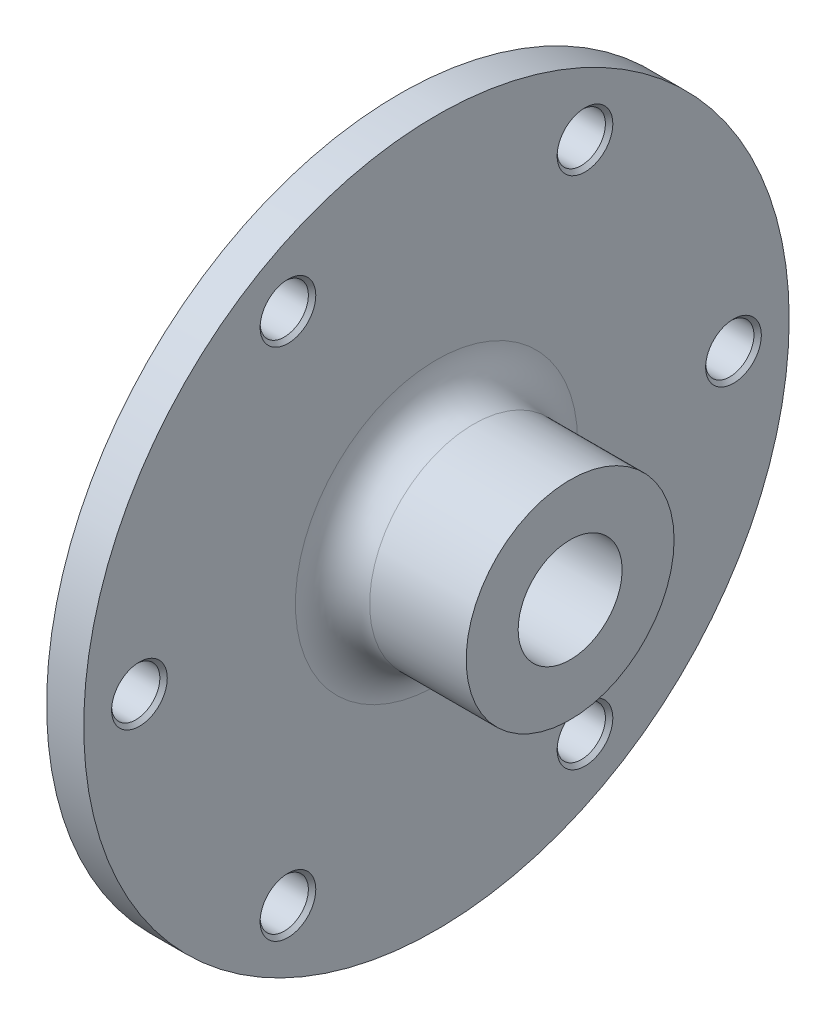
ISO-10303-21;
HEADER;
FILE_DESCRIPTION(('STEP AP214'),'2;1');
FILE_NAME('part.step','',(''),(''),'','','');
FILE_SCHEMA(('AUTOMOTIVE_DESIGN { 1 0 10303 214 1 1 1 1 }'));
ENDSEC;
DATA;
#1=APPLICATION_CONTEXT('core data for automotive mechanical design processes');
#2=APPLICATION_PROTOCOL_DEFINITION('international standard','automotive_design',2000,#1);
#3=PRODUCT_CONTEXT('',#1,'mechanical');
#4=PRODUCT('Part','Part','',(#3));
#5=PRODUCT_RELATED_PRODUCT_CATEGORY('part','',(#4));
#6=PRODUCT_DEFINITION_FORMATION('','',#4);
#7=PRODUCT_DEFINITION_CONTEXT('part definition',#1,'design');
#8=PRODUCT_DEFINITION('design','',#6,#7);
#9=PRODUCT_DEFINITION_SHAPE('','',#8);
#10=(LENGTH_UNIT() NAMED_UNIT(*) SI_UNIT(.MILLI.,.METRE.));
#11=(NAMED_UNIT(*) PLANE_ANGLE_UNIT() SI_UNIT($,.RADIAN.));
#12=(NAMED_UNIT(*) SI_UNIT($,.STERADIAN.) SOLID_ANGLE_UNIT());
#13=UNCERTAINTY_MEASURE_WITH_UNIT(LENGTH_MEASURE(1.E-05),#10,'distance_accuracy_value','');
#14=(GEOMETRIC_REPRESENTATION_CONTEXT(3) GLOBAL_UNCERTAINTY_ASSIGNED_CONTEXT((#13)) GLOBAL_UNIT_ASSIGNED_CONTEXT((#10,
#11,#12)) REPRESENTATION_CONTEXT('',''));
#15=CARTESIAN_POINT('',(0.,0.,0.));
#16=DIRECTION('',(0.,0.,1.));
#17=DIRECTION('',(1.,0.,0.));
#18=AXIS2_PLACEMENT_3D('',#15,#16,#17);
#19=CARTESIAN_POINT('',(0.,14.,0.));
#20=DIRECTION('',(1.,0.,0.));
#21=DIRECTION('',(0.,0.,-1.));
#22=AXIS2_PLACEMENT_3D('',#19,#20,#21);
#23=PLANE('',#22);
#24=CARTESIAN_POINT('',(0.,0.,0.));
#25=DIRECTION('',(-1.,0.,0.));
#26=DIRECTION('',(0.,0.,1.));
#27=AXIS2_PLACEMENT_3D('',#24,#25,#26);
#28=CIRCLE('',#27,6.99999999999999);
#29=CARTESIAN_POINT('',(0.,0.,6.99999999999999));
#30=VERTEX_POINT('',#29);
#31=EDGE_CURVE('E104',#30,#30,#28,.T.);
#32=ORIENTED_EDGE('',*,*,#31,.T.);
#33=EDGE_LOOP('',(#32));
#34=FACE_BOUND('',#33,.T.);
#35=CARTESIAN_POINT('',(0.,0.,0.));
#36=DIRECTION('',(1.,0.,0.));
#37=DIRECTION('',(0.,0.,-1.));
#38=AXIS2_PLACEMENT_3D('',#35,#36,#37);
#39=CIRCLE('',#38,14.);
#40=CARTESIAN_POINT('',(0.,0.,-14.));
#41=VERTEX_POINT('',#40);
#42=EDGE_CURVE('E107',#41,#41,#39,.T.);
#43=ORIENTED_EDGE('',*,*,#42,.T.);
#44=EDGE_LOOP('',(#43));
#45=FACE_BOUND('',#44,.T.);
#46=ADVANCED_FACE('F32',(#34,#45),#23,.T.);
#47=CARTESIAN_POINT('',(-28.,0.,0.));
#48=DIRECTION('',(-1.,0.,0.));
#49=DIRECTION('',(0.,0.,1.));
#50=AXIS2_PLACEMENT_3D('',#47,#48,#49);
#51=PLANE('',#50);
#52=CARTESIAN_POINT('',(-28.,0.,0.));
#53=DIRECTION('',(-1.,0.,0.));
#54=DIRECTION('',(0.,0.,1.));
#55=AXIS2_PLACEMENT_3D('',#52,#53,#54);
#56=CIRCLE('',#55,13.);
#57=CARTESIAN_POINT('',(-28.,0.,13.));
#58=VERTEX_POINT('',#57);
#59=EDGE_CURVE('E52',#58,#58,#56,.T.);
#60=ORIENTED_EDGE('',*,*,#59,.F.);
#61=EDGE_LOOP('',(#60));
#62=FACE_BOUND('',#61,.T.);
#63=CARTESIAN_POINT('',(-28.,0.,0.));
#64=DIRECTION('',(1.,0.,0.));
#65=DIRECTION('',(0.,0.,-1.));
#66=AXIS2_PLACEMENT_3D('',#63,#64,#65);
#67=CIRCLE('',#66,35.);
#68=CARTESIAN_POINT('',(-28.,0.,-35.));
#69=VERTEX_POINT('',#68);
#70=EDGE_CURVE('E45',#69,#69,#67,.T.);
#71=ORIENTED_EDGE('',*,*,#70,.F.);
#72=EDGE_LOOP('',(#71));
#73=FACE_BOUND('',#72,.T.);
#74=ADVANCED_FACE('F124',(#62,#73),#51,.T.);
#75=CARTESIAN_POINT('',(0.,0.,0.));
#76=DIRECTION('',(1.,0.,0.));
#77=DIRECTION('',(0.,0.,-1.));
#78=AXIS2_PLACEMENT_3D('',#75,#76,#77);
#79=CYLINDRICAL_SURFACE('',#78,35.);
#80=ORIENTED_EDGE('',*,*,#70,.T.);
#81=EDGE_LOOP('',(#80));
#82=FACE_BOUND('',#81,.T.);
#83=CARTESIAN_POINT('',(-23.,0.,0.));
#84=DIRECTION('',(1.,0.,0.));
#85=DIRECTION('',(0.,0.,-1.));
#86=AXIS2_PLACEMENT_3D('',#83,#84,#85);
#87=CIRCLE('',#86,35.);
#88=CARTESIAN_POINT('',(-23.,0.,-35.));
#89=VERTEX_POINT('',#88);
#90=EDGE_CURVE('E116',#89,#89,#87,.T.);
#91=ORIENTED_EDGE('',*,*,#90,.F.);
#92=EDGE_LOOP('',(#91));
#93=FACE_BOUND('',#92,.T.);
#94=ADVANCED_FACE('F121',(#82,#93),#79,.T.);
#95=CARTESIAN_POINT('',(-23.,35.,0.));
#96=DIRECTION('',(-1.,0.,0.));
#97=DIRECTION('',(0.,0.,1.));
#98=AXIS2_PLACEMENT_3D('',#95,#96,#97);
#99=PLANE('',#98);
#100=CARTESIAN_POINT('',(-23.,34.6410161513773,20.0000000000004));
#101=DIRECTION('',(-1.,0.,0.));
#102=DIRECTION('',(0.,0.,1.));
#103=AXIS2_PLACEMENT_3D('',#100,#101,#102);
#104=CIRCLE('',#103,3.25);
#105=CARTESIAN_POINT('',(-23.,34.6410161513773,23.2500000000004));
#106=VERTEX_POINT('',#105);
#107=EDGE_CURVE('E36',#106,#106,#104,.T.);
#108=ORIENTED_EDGE('',*,*,#107,.F.);
#109=EDGE_LOOP('',(#108));
#110=FACE_BOUND('',#109,.T.);
#111=CARTESIAN_POINT('',(-23.,34.6410161513777,-19.9999999999997));
#112=DIRECTION('',(-1.,0.,0.));
#113=DIRECTION('',(0.,0.,1.));
#114=AXIS2_PLACEMENT_3D('',#111,#112,#113);
#115=CIRCLE('',#114,3.25);
#116=CARTESIAN_POINT('',(-23.,34.6410161513777,-16.7499999999997));
#117=VERTEX_POINT('',#116);
#118=EDGE_CURVE('E68',#117,#117,#115,.T.);
#119=ORIENTED_EDGE('',*,*,#118,.F.);
#120=EDGE_LOOP('',(#119));
#121=FACE_BOUND('',#120,.T.);
#122=CARTESIAN_POINT('',(-23.,0.,-40.));
#123=DIRECTION('',(-1.,0.,0.));
#124=DIRECTION('',(0.,0.,1.));
#125=AXIS2_PLACEMENT_3D('',#122,#123,#124);
#126=CIRCLE('',#125,3.25);
#127=CARTESIAN_POINT('',(-23.,0.,-36.75));
#128=VERTEX_POINT('',#127);
#129=EDGE_CURVE('E64',#128,#128,#126,.T.);
#130=ORIENTED_EDGE('',*,*,#129,.F.);
#131=EDGE_LOOP('',(#130));
#132=FACE_BOUND('',#131,.T.);
#133=CARTESIAN_POINT('',(-23.,-34.6410161513775,-20.0000000000002));
#134=DIRECTION('',(-1.,0.,0.));
#135=DIRECTION('',(0.,0.,1.));
#136=AXIS2_PLACEMENT_3D('',#133,#134,#135);
#137=CIRCLE('',#136,3.25);
#138=CARTESIAN_POINT('',(-23.,-34.6410161513775,-16.7500000000002));
#139=VERTEX_POINT('',#138);
#140=EDGE_CURVE('E59',#139,#139,#137,.T.);
#141=ORIENTED_EDGE('',*,*,#140,.F.);
#142=EDGE_LOOP('',(#141));
#143=FACE_BOUND('',#142,.T.);
#144=CARTESIAN_POINT('',(-23.,-34.6410161513776,19.9999999999999));
#145=DIRECTION('',(-1.,0.,0.));
#146=DIRECTION('',(0.,0.,1.));
#147=AXIS2_PLACEMENT_3D('',#144,#145,#146);
#148=CIRCLE('',#147,3.25);
#149=CARTESIAN_POINT('',(-23.,-34.6410161513776,23.2499999999999));
#150=VERTEX_POINT('',#149);
#151=EDGE_CURVE('E54',#150,#150,#148,.T.);
#152=ORIENTED_EDGE('',*,*,#151,.F.);
#153=EDGE_LOOP('',(#152));
#154=FACE_BOUND('',#153,.T.);
#155=CARTESIAN_POINT('',(-23.,0.,40.));
#156=DIRECTION('',(-1.,0.,0.));
#157=DIRECTION('',(0.,0.,1.));
#158=AXIS2_PLACEMENT_3D('',#155,#156,#157);
#159=CIRCLE('',#158,3.25);
#160=CARTESIAN_POINT('',(-23.,0.,43.25));
#161=VERTEX_POINT('',#160);
#162=EDGE_CURVE('E49',#161,#161,#159,.T.);
#163=ORIENTED_EDGE('',*,*,#162,.F.);
#164=EDGE_LOOP('',(#163));
#165=FACE_BOUND('',#164,.T.);
#166=ORIENTED_EDGE('',*,*,#90,.T.);
#167=EDGE_LOOP('',(#166));
#168=FACE_BOUND('',#167,.T.);
#169=CARTESIAN_POINT('',(-23.,0.,0.));
#170=DIRECTION('',(1.,0.,0.));
#171=DIRECTION('',(0.,0.,-1.));
#172=AXIS2_PLACEMENT_3D('',#169,#170,#171);
#173=CIRCLE('',#172,47.5);
#174=CARTESIAN_POINT('',(-23.,0.,-47.5));
#175=VERTEX_POINT('',#174);
#176=EDGE_CURVE('E113',#175,#175,#173,.T.);
#177=ORIENTED_EDGE('',*,*,#176,.F.);
#178=EDGE_LOOP('',(#177));
#179=FACE_BOUND('',#178,.T.);
#180=ADVANCED_FACE('F132',(#110,#121,#132,#143,#154,#165,#168,#179),#99,.T.);
#181=CARTESIAN_POINT('',(0.,0.,0.));
#182=DIRECTION('',(1.,0.,0.));
#183=DIRECTION('',(0.,0.,-1.));
#184=AXIS2_PLACEMENT_3D('',#181,#182,#183);
#185=CYLINDRICAL_SURFACE('',#184,47.5);
#186=ORIENTED_EDGE('',*,*,#176,.T.);
#187=EDGE_LOOP('',(#186));
#188=FACE_BOUND('',#187,.T.);
#189=CARTESIAN_POINT('',(-18.,0.,0.));
#190=DIRECTION('',(1.,0.,0.));
#191=DIRECTION('',(0.,0.,-1.));
#192=AXIS2_PLACEMENT_3D('',#189,#190,#191);
#193=CIRCLE('',#192,47.5);
#194=CARTESIAN_POINT('',(-18.,0.,-47.5));
#195=VERTEX_POINT('',#194);
#196=EDGE_CURVE('E110',#195,#195,#193,.T.);
#197=ORIENTED_EDGE('',*,*,#196,.F.);
#198=EDGE_LOOP('',(#197));
#199=FACE_BOUND('',#198,.T.);
#200=ADVANCED_FACE('F139',(#188,#199),#185,.T.);
#201=CARTESIAN_POINT('',(-18.,47.5,0.));
#202=DIRECTION('',(1.,0.,0.));
#203=DIRECTION('',(0.,0.,-1.));
#204=AXIS2_PLACEMENT_3D('',#201,#202,#203);
#205=PLANE('',#204);
#206=CARTESIAN_POINT('',(-18.,34.6410161513773,20.0000000000004));
#207=DIRECTION('',(1.,0.,0.));
#208=DIRECTION('',(0.,0.,-1.));
#209=AXIS2_PLACEMENT_3D('',#206,#207,#208);
#210=CIRCLE('',#209,3.75);
#211=CARTESIAN_POINT('',(-18.,34.6410161513773,16.2500000000004));
#212=VERTEX_POINT('',#211);
#213=EDGE_CURVE('E214',#212,#212,#210,.T.);
#214=ORIENTED_EDGE('',*,*,#213,.F.);
#215=EDGE_LOOP('',(#214));
#216=FACE_BOUND('',#215,.T.);
#217=CARTESIAN_POINT('',(-18.,34.6410161513777,-19.9999999999997));
#218=DIRECTION('',(1.,0.,0.));
#219=DIRECTION('',(0.,0.,-1.));
#220=AXIS2_PLACEMENT_3D('',#217,#218,#219);
#221=CIRCLE('',#220,3.75);
#222=CARTESIAN_POINT('',(-18.,34.6410161513777,-23.7499999999997));
#223=VERTEX_POINT('',#222);
#224=EDGE_CURVE('E77',#223,#223,#221,.T.);
#225=ORIENTED_EDGE('',*,*,#224,.F.);
#226=EDGE_LOOP('',(#225));
#227=FACE_BOUND('',#226,.T.);
#228=CARTESIAN_POINT('',(-18.,0.,-40.));
#229=DIRECTION('',(1.,0.,0.));
#230=DIRECTION('',(0.,0.,-1.));
#231=AXIS2_PLACEMENT_3D('',#228,#229,#230);
#232=CIRCLE('',#231,3.75);
#233=CARTESIAN_POINT('',(-18.,0.,-43.75));
#234=VERTEX_POINT('',#233);
#235=EDGE_CURVE('E70',#234,#234,#232,.T.);
#236=ORIENTED_EDGE('',*,*,#235,.F.);
#237=EDGE_LOOP('',(#236));
#238=FACE_BOUND('',#237,.T.);
#239=CARTESIAN_POINT('',(-18.,-34.6410161513775,-20.0000000000002));
#240=DIRECTION('',(1.,0.,0.));
#241=DIRECTION('',(0.,0.,-1.));
#242=AXIS2_PLACEMENT_3D('',#239,#240,#241);
#243=CIRCLE('',#242,3.75);
#244=CARTESIAN_POINT('',(-18.,-34.6410161513775,-23.7500000000002));
#245=VERTEX_POINT('',#244);
#246=EDGE_CURVE('E66',#245,#245,#243,.T.);
#247=ORIENTED_EDGE('',*,*,#246,.F.);
#248=EDGE_LOOP('',(#247));
#249=FACE_BOUND('',#248,.T.);
#250=CARTESIAN_POINT('',(-18.,-34.6410161513776,19.9999999999999));
#251=DIRECTION('',(1.,0.,0.));
#252=DIRECTION('',(0.,0.,-1.));
#253=AXIS2_PLACEMENT_3D('',#250,#251,#252);
#254=CIRCLE('',#253,3.75);
#255=CARTESIAN_POINT('',(-18.,-34.6410161513776,16.2499999999999));
#256=VERTEX_POINT('',#255);
#257=EDGE_CURVE('E62',#256,#256,#254,.T.);
#258=ORIENTED_EDGE('',*,*,#257,.F.);
#259=EDGE_LOOP('',(#258));
#260=FACE_BOUND('',#259,.T.);
#261=CARTESIAN_POINT('',(-18.,0.,40.));
#262=DIRECTION('',(1.,0.,0.));
#263=DIRECTION('',(0.,0.,-1.));
#264=AXIS2_PLACEMENT_3D('',#261,#262,#263);
#265=CIRCLE('',#264,3.75);
#266=CARTESIAN_POINT('',(-18.,0.,36.25));
#267=VERTEX_POINT('',#266);
#268=EDGE_CURVE('E57',#267,#267,#265,.T.);
#269=ORIENTED_EDGE('',*,*,#268,.F.);
#270=EDGE_LOOP('',(#269));
#271=FACE_BOUND('',#270,.T.);
#272=CARTESIAN_POINT('',(-18.,0.,0.));
#273=DIRECTION('',(1.,0.,0.));
#274=DIRECTION('',(0.,0.,-1.));
#275=AXIS2_PLACEMENT_3D('',#272,#273,#274);
#276=CIRCLE('',#275,19.);
#277=CARTESIAN_POINT('',(-18.,0.,-19.));
#278=VERTEX_POINT('',#277);
#279=EDGE_CURVE('E10',#278,#278,#276,.F.);
#280=ORIENTED_EDGE('',*,*,#279,.T.);
#281=EDGE_LOOP('',(#280));
#282=FACE_BOUND('',#281,.T.);
#283=ORIENTED_EDGE('',*,*,#196,.T.);
#284=EDGE_LOOP('',(#283));
#285=FACE_BOUND('',#284,.T.);
#286=ADVANCED_FACE('F143',(#216,#227,#238,#249,#260,#271,#282,#285),#205,.T.);
#287=CARTESIAN_POINT('',(0.,0.,0.));
#288=DIRECTION('',(1.,0.,0.));
#289=DIRECTION('',(0.,0.,-1.));
#290=AXIS2_PLACEMENT_3D('',#287,#288,#289);
#291=CYLINDRICAL_SURFACE('',#290,14.);
#292=CARTESIAN_POINT('',(-13.,0.,0.));
#293=DIRECTION('',(1.,0.,0.));
#294=DIRECTION('',(0.,0.,-1.));
#295=AXIS2_PLACEMENT_3D('',#292,#293,#294);
#296=CIRCLE('',#295,14.);
#297=CARTESIAN_POINT('',(-13.,0.,-14.));
#298=VERTEX_POINT('',#297);
#299=EDGE_CURVE('E40',#298,#298,#296,.T.);
#300=ORIENTED_EDGE('',*,*,#299,.T.);
#301=EDGE_LOOP('',(#300));
#302=FACE_BOUND('',#301,.T.);
#303=ORIENTED_EDGE('',*,*,#42,.F.);
#304=EDGE_LOOP('',(#303));
#305=FACE_BOUND('',#304,.T.);
#306=ADVANCED_FACE('F147',(#302,#305),#291,.T.);
#307=CARTESIAN_POINT('',(-13.,0.,0.));
#308=DIRECTION('',(1.,0.,0.));
#309=DIRECTION('',(0.,0.,-1.));
#310=AXIS2_PLACEMENT_3D('',#307,#308,#309);
#311=TOROIDAL_SURFACE('',#310,19.,5.);
#312=ORIENTED_EDGE('',*,*,#279,.F.);
#313=EDGE_LOOP('',(#312));
#314=FACE_BOUND('',#313,.T.);
#315=ORIENTED_EDGE('',*,*,#299,.F.);
#316=EDGE_LOOP('',(#315));
#317=FACE_BOUND('',#316,.T.);
#318=ADVANCED_FACE('F34',(#314,#317),#311,.F.);
#319=CARTESIAN_POINT('',(-28.,0.,0.));
#320=DIRECTION('',(-1.,0.,0.));
#321=DIRECTION('',(0.,0.,1.));
#322=AXIS2_PLACEMENT_3D('',#319,#320,#321);
#323=CYLINDRICAL_SURFACE('',#322,6.99999999999999);
#324=ORIENTED_EDGE('',*,*,#31,.F.);
#325=EDGE_LOOP('',(#324));
#326=FACE_BOUND('',#325,.T.);
#327=CARTESIAN_POINT('',(-22.,0.,0.));
#328=DIRECTION('',(-1.,0.,0.));
#329=DIRECTION('',(0.,0.,1.));
#330=AXIS2_PLACEMENT_3D('',#327,#328,#329);
#331=CIRCLE('',#330,7.);
#332=CARTESIAN_POINT('',(-22.,0.,7.));
#333=VERTEX_POINT('',#332);
#334=EDGE_CURVE('E101',#333,#333,#331,.T.);
#335=ORIENTED_EDGE('',*,*,#334,.T.);
#336=EDGE_LOOP('',(#335));
#337=FACE_BOUND('',#336,.T.);
#338=ADVANCED_FACE('F152',(#326,#337),#323,.F.);
#339=CARTESIAN_POINT('',(-28.,0.,0.));
#340=DIRECTION('',(-1.,0.,0.));
#341=DIRECTION('',(0.,0.,1.));
#342=AXIS2_PLACEMENT_3D('',#339,#340,#341);
#343=CONICAL_SURFACE('',#342,13.,0.785398163397449);
#344=ORIENTED_EDGE('',*,*,#334,.F.);
#345=EDGE_LOOP('',(#344));
#346=FACE_BOUND('',#345,.T.);
#347=ORIENTED_EDGE('',*,*,#59,.T.);
#348=EDGE_LOOP('',(#347));
#349=FACE_BOUND('',#348,.T.);
#350=ADVANCED_FACE('F155',(#346,#349),#343,.F.);
#351=CARTESIAN_POINT('',(-18.,0.,40.));
#352=DIRECTION('',(1.,0.,0.));
#353=DIRECTION('',(0.,0.,-1.));
#354=AXIS2_PLACEMENT_3D('',#351,#352,#353);
#355=CYLINDRICAL_SURFACE('',#354,3.25);
#356=ORIENTED_EDGE('',*,*,#162,.T.);
#357=EDGE_LOOP('',(#356));
#358=FACE_BOUND('',#357,.T.);
#359=CARTESIAN_POINT('',(-18.5,0.,40.));
#360=DIRECTION('',(1.,0.,0.));
#361=DIRECTION('',(0.,0.,-1.));
#362=AXIS2_PLACEMENT_3D('',#359,#360,#361);
#363=CIRCLE('',#362,3.25);
#364=CARTESIAN_POINT('',(-18.5,0.,36.75));
#365=VERTEX_POINT('',#364);
#366=EDGE_CURVE('E53',#365,#365,#363,.T.);
#367=ORIENTED_EDGE('',*,*,#366,.T.);
#368=EDGE_LOOP('',(#367));
#369=FACE_BOUND('',#368,.T.);
#370=ADVANCED_FACE('F159',(#358,#369),#355,.F.);
#371=CARTESIAN_POINT('',(-18.,0.,40.));
#372=DIRECTION('',(1.,0.,0.));
#373=DIRECTION('',(0.,0.,-1.));
#374=AXIS2_PLACEMENT_3D('',#371,#372,#373);
#375=CONICAL_SURFACE('',#374,3.75,0.785398163397447);
#376=ORIENTED_EDGE('',*,*,#366,.F.);
#377=EDGE_LOOP('',(#376));
#378=FACE_BOUND('',#377,.T.);
#379=ORIENTED_EDGE('',*,*,#268,.T.);
#380=EDGE_LOOP('',(#379));
#381=FACE_BOUND('',#380,.T.);
#382=ADVANCED_FACE('F163',(#378,#381),#375,.F.);
#383=CARTESIAN_POINT('',(-18.,-34.6410161513776,19.9999999999999));
#384=DIRECTION('',(1.,0.,0.));
#385=DIRECTION('',(0.,0.,-1.));
#386=AXIS2_PLACEMENT_3D('',#383,#384,#385);
#387=CYLINDRICAL_SURFACE('',#386,3.25);
#388=ORIENTED_EDGE('',*,*,#151,.T.);
#389=EDGE_LOOP('',(#388));
#390=FACE_BOUND('',#389,.T.);
#391=CARTESIAN_POINT('',(-18.5,-34.6410161513776,19.9999999999999));
#392=DIRECTION('',(1.,0.,0.));
#393=DIRECTION('',(0.,0.,-1.));
#394=AXIS2_PLACEMENT_3D('',#391,#392,#393);
#395=CIRCLE('',#394,3.25);
#396=CARTESIAN_POINT('',(-18.5,-34.6410161513776,16.7499999999999));
#397=VERTEX_POINT('',#396);
#398=EDGE_CURVE('E58',#397,#397,#395,.T.);
#399=ORIENTED_EDGE('',*,*,#398,.T.);
#400=EDGE_LOOP('',(#399));
#401=FACE_BOUND('',#400,.T.);
#402=ADVANCED_FACE('F167',(#390,#401),#387,.F.);
#403=CARTESIAN_POINT('',(-18.,-34.6410161513776,19.9999999999999));
#404=DIRECTION('',(1.,0.,0.));
#405=DIRECTION('',(0.,0.,-1.));
#406=AXIS2_PLACEMENT_3D('',#403,#404,#405);
#407=CONICAL_SURFACE('',#406,3.75,0.785398163397448);
#408=ORIENTED_EDGE('',*,*,#398,.F.);
#409=EDGE_LOOP('',(#408));
#410=FACE_BOUND('',#409,.T.);
#411=ORIENTED_EDGE('',*,*,#257,.T.);
#412=EDGE_LOOP('',(#411));
#413=FACE_BOUND('',#412,.T.);
#414=ADVANCED_FACE('F171',(#410,#413),#407,.F.);
#415=CARTESIAN_POINT('',(-18.,-34.6410161513775,-20.0000000000002));
#416=DIRECTION('',(1.,0.,0.));
#417=DIRECTION('',(0.,0.,-1.));
#418=AXIS2_PLACEMENT_3D('',#415,#416,#417);
#419=CYLINDRICAL_SURFACE('',#418,3.25);
#420=ORIENTED_EDGE('',*,*,#140,.T.);
#421=EDGE_LOOP('',(#420));
#422=FACE_BOUND('',#421,.T.);
#423=CARTESIAN_POINT('',(-18.5,-34.6410161513775,-20.0000000000002));
#424=DIRECTION('',(1.,0.,0.));
#425=DIRECTION('',(0.,0.,-1.));
#426=AXIS2_PLACEMENT_3D('',#423,#424,#425);
#427=CIRCLE('',#426,3.25);
#428=CARTESIAN_POINT('',(-18.5,-34.6410161513775,-23.2500000000002));
#429=VERTEX_POINT('',#428);
#430=EDGE_CURVE('E63',#429,#429,#427,.T.);
#431=ORIENTED_EDGE('',*,*,#430,.T.);
#432=EDGE_LOOP('',(#431));
#433=FACE_BOUND('',#432,.T.);
#434=ADVANCED_FACE('F175',(#422,#433),#419,.F.);
#435=CARTESIAN_POINT('',(-18.,-34.6410161513775,-20.0000000000002));
#436=DIRECTION('',(1.,0.,0.));
#437=DIRECTION('',(0.,0.,-1.));
#438=AXIS2_PLACEMENT_3D('',#435,#436,#437);
#439=CONICAL_SURFACE('',#438,3.75,0.785398163397448);
#440=ORIENTED_EDGE('',*,*,#430,.F.);
#441=EDGE_LOOP('',(#440));
#442=FACE_BOUND('',#441,.T.);
#443=ORIENTED_EDGE('',*,*,#246,.T.);
#444=EDGE_LOOP('',(#443));
#445=FACE_BOUND('',#444,.T.);
#446=ADVANCED_FACE('F179',(#442,#445),#439,.F.);
#447=CARTESIAN_POINT('',(-18.,0.,-40.));
#448=DIRECTION('',(1.,0.,0.));
#449=DIRECTION('',(0.,0.,-1.));
#450=AXIS2_PLACEMENT_3D('',#447,#448,#449);
#451=CYLINDRICAL_SURFACE('',#450,3.25);
#452=ORIENTED_EDGE('',*,*,#129,.T.);
#453=EDGE_LOOP('',(#452));
#454=FACE_BOUND('',#453,.T.);
#455=CARTESIAN_POINT('',(-18.5,0.,-40.));
#456=DIRECTION('',(1.,0.,0.));
#457=DIRECTION('',(0.,0.,-1.));
#458=AXIS2_PLACEMENT_3D('',#455,#456,#457);
#459=CIRCLE('',#458,3.25);
#460=CARTESIAN_POINT('',(-18.5,0.,-43.25));
#461=VERTEX_POINT('',#460);
#462=EDGE_CURVE('E67',#461,#461,#459,.T.);
#463=ORIENTED_EDGE('',*,*,#462,.T.);
#464=EDGE_LOOP('',(#463));
#465=FACE_BOUND('',#464,.T.);
#466=ADVANCED_FACE('F183',(#454,#465),#451,.F.);
#467=CARTESIAN_POINT('',(-18.,0.,-40.));
#468=DIRECTION('',(1.,0.,0.));
#469=DIRECTION('',(0.,0.,-1.));
#470=AXIS2_PLACEMENT_3D('',#467,#468,#469);
#471=CONICAL_SURFACE('',#470,3.75,0.785398163397447);
#472=ORIENTED_EDGE('',*,*,#462,.F.);
#473=EDGE_LOOP('',(#472));
#474=FACE_BOUND('',#473,.T.);
#475=ORIENTED_EDGE('',*,*,#235,.T.);
#476=EDGE_LOOP('',(#475));
#477=FACE_BOUND('',#476,.T.);
#478=ADVANCED_FACE('F187',(#474,#477),#471,.F.);
#479=CARTESIAN_POINT('',(-18.,34.6410161513777,-19.9999999999997));
#480=DIRECTION('',(1.,0.,0.));
#481=DIRECTION('',(0.,0.,-1.));
#482=AXIS2_PLACEMENT_3D('',#479,#480,#481);
#483=CYLINDRICAL_SURFACE('',#482,3.25);
#484=ORIENTED_EDGE('',*,*,#118,.T.);
#485=EDGE_LOOP('',(#484));
#486=FACE_BOUND('',#485,.T.);
#487=CARTESIAN_POINT('',(-18.5,34.6410161513777,-19.9999999999997));
#488=DIRECTION('',(1.,0.,0.));
#489=DIRECTION('',(0.,0.,-1.));
#490=AXIS2_PLACEMENT_3D('',#487,#488,#489);
#491=CIRCLE('',#490,3.25);
#492=CARTESIAN_POINT('',(-18.5,34.6410161513777,-23.2499999999997));
#493=VERTEX_POINT('',#492);
#494=EDGE_CURVE('E71',#493,#493,#491,.T.);
#495=ORIENTED_EDGE('',*,*,#494,.T.);
#496=EDGE_LOOP('',(#495));
#497=FACE_BOUND('',#496,.T.);
#498=ADVANCED_FACE('F191',(#486,#497),#483,.F.);
#499=CARTESIAN_POINT('',(-18.,34.6410161513777,-19.9999999999997));
#500=DIRECTION('',(1.,0.,0.));
#501=DIRECTION('',(0.,0.,-1.));
#502=AXIS2_PLACEMENT_3D('',#499,#500,#501);
#503=CONICAL_SURFACE('',#502,3.75,0.785398163397445);
#504=ORIENTED_EDGE('',*,*,#494,.F.);
#505=EDGE_LOOP('',(#504));
#506=FACE_BOUND('',#505,.T.);
#507=ORIENTED_EDGE('',*,*,#224,.T.);
#508=EDGE_LOOP('',(#507));
#509=FACE_BOUND('',#508,.T.);
#510=ADVANCED_FACE('F195',(#506,#509),#503,.F.);
#511=CARTESIAN_POINT('',(-18.,34.6410161513773,20.0000000000004));
#512=DIRECTION('',(1.,0.,0.));
#513=DIRECTION('',(0.,0.,-1.));
#514=AXIS2_PLACEMENT_3D('',#511,#512,#513);
#515=CYLINDRICAL_SURFACE('',#514,3.25);
#516=ORIENTED_EDGE('',*,*,#107,.T.);
#517=EDGE_LOOP('',(#516));
#518=FACE_BOUND('',#517,.T.);
#519=CARTESIAN_POINT('',(-18.5,34.6410161513773,20.0000000000004));
#520=DIRECTION('',(1.,0.,0.));
#521=DIRECTION('',(0.,0.,-1.));
#522=AXIS2_PLACEMENT_3D('',#519,#520,#521);
#523=CIRCLE('',#522,3.25);
#524=CARTESIAN_POINT('',(-18.5,34.6410161513773,16.7500000000004));
#525=VERTEX_POINT('',#524);
#526=EDGE_CURVE('E211',#525,#525,#523,.T.);
#527=ORIENTED_EDGE('',*,*,#526,.T.);
#528=EDGE_LOOP('',(#527));
#529=FACE_BOUND('',#528,.T.);
#530=ADVANCED_FACE('F198',(#518,#529),#515,.F.);
#531=CARTESIAN_POINT('',(-18.,34.6410161513773,20.0000000000004));
#532=DIRECTION('',(1.,0.,0.));
#533=DIRECTION('',(0.,0.,-1.));
#534=AXIS2_PLACEMENT_3D('',#531,#532,#533);
#535=CONICAL_SURFACE('',#534,3.75,0.785398163397445);
#536=ORIENTED_EDGE('',*,*,#526,.F.);
#537=EDGE_LOOP('',(#536));
#538=FACE_BOUND('',#537,.T.);
#539=ORIENTED_EDGE('',*,*,#213,.T.);
#540=EDGE_LOOP('',(#539));
#541=FACE_BOUND('',#540,.T.);
#542=ADVANCED_FACE('F202',(#538,#541),#535,.F.);
#543=CLOSED_SHELL('',(#46,#74,#94,#180,#200,#286,#306,#318,#338,#350,#370,#382,#402,#414,#434,
#446,#466,#478,#498,#510,#530,#542));
#544=MANIFOLD_SOLID_BREP('B2',#543);
#545=ADVANCED_BREP_SHAPE_REPRESENTATION('',(#18,#544),#14);
#546=SHAPE_DEFINITION_REPRESENTATION(#9,#545);
ENDSEC;
END-ISO-10303-21;
